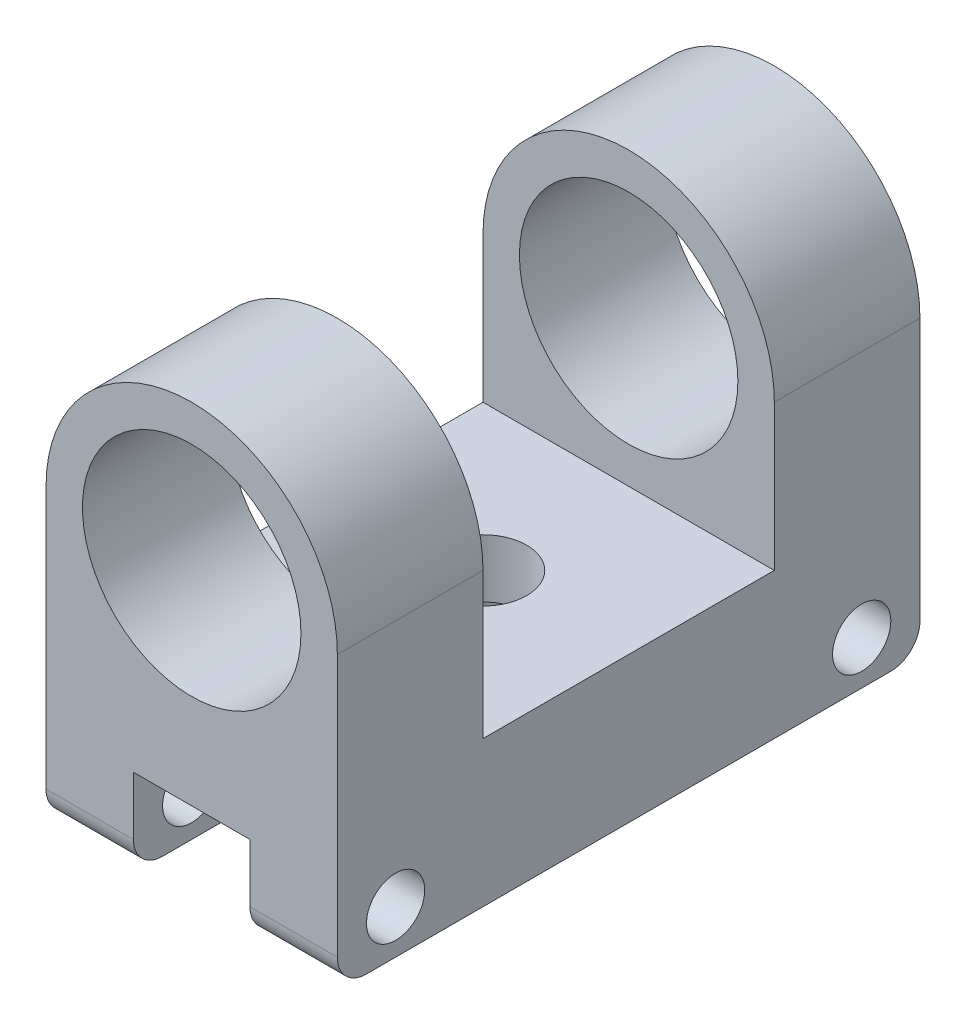
ISO-10303-21;
HEADER;
FILE_DESCRIPTION(('STEP AP214'),'2;1');
FILE_NAME('part.step','',(''),(''),'','','');
FILE_SCHEMA(('AUTOMOTIVE_DESIGN { 1 0 10303 214 1 1 1 1 }'));
ENDSEC;
DATA;
#1=APPLICATION_CONTEXT('core data for automotive mechanical design processes');
#2=APPLICATION_PROTOCOL_DEFINITION('international standard','automotive_design',2000,#1);
#3=PRODUCT_CONTEXT('',#1,'mechanical');
#4=PRODUCT('Part','Part','',(#3));
#5=PRODUCT_RELATED_PRODUCT_CATEGORY('part','',(#4));
#6=PRODUCT_DEFINITION_FORMATION('','',#4);
#7=PRODUCT_DEFINITION_CONTEXT('part definition',#1,'design');
#8=PRODUCT_DEFINITION('design','',#6,#7);
#9=PRODUCT_DEFINITION_SHAPE('','',#8);
#10=(LENGTH_UNIT() NAMED_UNIT(*) SI_UNIT(.MILLI.,.METRE.));
#11=(NAMED_UNIT(*) PLANE_ANGLE_UNIT() SI_UNIT($,.RADIAN.));
#12=(NAMED_UNIT(*) SI_UNIT($,.STERADIAN.) SOLID_ANGLE_UNIT());
#13=UNCERTAINTY_MEASURE_WITH_UNIT(LENGTH_MEASURE(1.E-05),#10,'distance_accuracy_value','');
#14=(GEOMETRIC_REPRESENTATION_CONTEXT(3) GLOBAL_UNCERTAINTY_ASSIGNED_CONTEXT((#13)) GLOBAL_UNIT_ASSIGNED_CONTEXT((#10,
#11,#12)) REPRESENTATION_CONTEXT('',''));
#15=CARTESIAN_POINT('',(0.,0.,0.));
#16=DIRECTION('',(0.,0.,1.));
#17=DIRECTION('',(1.,0.,0.));
#18=AXIS2_PLACEMENT_3D('',#15,#16,#17);
#19=CARTESIAN_POINT('',(50.,100.,-200.));
#20=DIRECTION('',(0.,0.,1.));
#21=DIRECTION('',(1.,0.,0.));
#22=AXIS2_PLACEMENT_3D('',#19,#20,#21);
#23=CYLINDRICAL_SURFACE('',#22,50.);
#24=CARTESIAN_POINT('',(50.,100.,-50.));
#25=DIRECTION('',(0.,0.,1.));
#26=DIRECTION('',(0.,-1.,0.));
#27=AXIS2_PLACEMENT_3D('',#24,#25,#26);
#28=CIRCLE('',#27,50.);
#29=CARTESIAN_POINT('',(0.,100.,-50.));
#30=VERTEX_POINT('',#29);
#31=CARTESIAN_POINT('',(100.,100.,-50.));
#32=VERTEX_POINT('',#31);
#33=EDGE_CURVE('E204',#30,#32,#28,.F.);
#34=ORIENTED_EDGE('',*,*,#33,.F.);
#35=DIRECTION('',(0.,0.,1.));
#36=VECTOR('',#35,1.);
#37=CARTESIAN_POINT('',(0.,100.,-200.));
#38=LINE('',#37,#36);
#39=CARTESIAN_POINT('',(0.,100.,0.));
#40=VERTEX_POINT('',#39);
#41=EDGE_CURVE('E302',#30,#40,#38,.T.);
#42=ORIENTED_EDGE('',*,*,#41,.T.);
#43=CARTESIAN_POINT('',(50.,100.,0.));
#44=DIRECTION('',(0.,0.,1.));
#45=DIRECTION('',(1.,0.,0.));
#46=AXIS2_PLACEMENT_3D('',#43,#44,#45);
#47=CIRCLE('',#46,50.);
#48=CARTESIAN_POINT('',(100.,100.,0.));
#49=VERTEX_POINT('',#48);
#50=EDGE_CURVE('E280',#49,#40,#47,.T.);
#51=ORIENTED_EDGE('',*,*,#50,.F.);
#52=DIRECTION('',(0.,0.,1.));
#53=VECTOR('',#52,1.);
#54=CARTESIAN_POINT('',(100.,100.,-200.));
#55=LINE('',#54,#53);
#56=EDGE_CURVE('E305',#32,#49,#55,.T.);
#57=ORIENTED_EDGE('',*,*,#56,.F.);
#58=EDGE_LOOP('',(#34,#42,#51,#57));
#59=FACE_BOUND('',#58,.T.);
#60=ADVANCED_FACE('F45',(#59),#23,.T.);
#61=CARTESIAN_POINT('',(50.,100.,-200.));
#62=DIRECTION('',(0.,0.,1.));
#63=DIRECTION('',(1.,0.,0.));
#64=AXIS2_PLACEMENT_3D('',#61,#62,#63);
#65=CYLINDRICAL_SURFACE('',#64,37.5);
#66=CARTESIAN_POINT('',(50.,100.,-50.));
#67=DIRECTION('',(0.,0.,1.));
#68=DIRECTION('',(0.,-1.,0.));
#69=AXIS2_PLACEMENT_3D('',#66,#67,#68);
#70=CIRCLE('',#69,37.5);
#71=CARTESIAN_POINT('',(50.,62.5,-50.));
#72=VERTEX_POINT('',#71);
#73=EDGE_CURVE('E203',#72,#72,#70,.F.);
#74=ORIENTED_EDGE('',*,*,#73,.T.);
#75=EDGE_LOOP('',(#74));
#76=FACE_BOUND('',#75,.T.);
#77=CARTESIAN_POINT('',(50.,100.,0.));
#78=DIRECTION('',(0.,0.,1.));
#79=DIRECTION('',(1.,0.,0.));
#80=AXIS2_PLACEMENT_3D('',#77,#78,#79);
#81=CIRCLE('',#80,37.5);
#82=CARTESIAN_POINT('',(87.5,100.,0.));
#83=VERTEX_POINT('',#82);
#84=EDGE_CURVE('E237',#83,#83,#81,.T.);
#85=ORIENTED_EDGE('',*,*,#84,.T.);
#86=EDGE_LOOP('',(#85));
#87=FACE_BOUND('',#86,.T.);
#88=ADVANCED_FACE('F407',(#76,#87),#65,.F.);
#89=CARTESIAN_POINT('',(0.,0.,-200.));
#90=DIRECTION('',(0.,-1.,0.));
#91=DIRECTION('',(0.,0.,-1.));
#92=AXIS2_PLACEMENT_3D('',#89,#90,#91);
#93=PLANE('',#92);
#94=DIRECTION('',(0.,0.,1.));
#95=VECTOR('',#94,1.);
#96=CARTESIAN_POINT('',(30.,0.,-200.));
#97=LINE('',#96,#95);
#98=CARTESIAN_POINT('',(30.,0.,-190.));
#99=VERTEX_POINT('',#98);
#100=CARTESIAN_POINT('',(30.,0.,-10.));
#101=VERTEX_POINT('',#100);
#102=EDGE_CURVE('E241',#99,#101,#97,.T.);
#103=ORIENTED_EDGE('',*,*,#102,.T.);
#104=DIRECTION('',(1.,0.,0.));
#105=VECTOR('',#104,1.);
#106=CARTESIAN_POINT('',(0.,0.,-10.));
#107=LINE('',#106,#105);
#108=CARTESIAN_POINT('',(0.,0.,-10.));
#109=VERTEX_POINT('',#108);
#110=EDGE_CURVE('E342',#101,#109,#107,.F.);
#111=ORIENTED_EDGE('',*,*,#110,.T.);
#112=DIRECTION('',(0.,0.,1.));
#113=VECTOR('',#112,1.);
#114=CARTESIAN_POINT('',(0.,0.,-200.));
#115=LINE('',#114,#113);
#116=CARTESIAN_POINT('',(0.,0.,-190.));
#117=VERTEX_POINT('',#116);
#118=EDGE_CURVE('E287',#117,#109,#115,.T.);
#119=ORIENTED_EDGE('',*,*,#118,.F.);
#120=DIRECTION('',(1.,0.,0.));
#121=VECTOR('',#120,1.);
#122=CARTESIAN_POINT('',(30.,0.,-190.));
#123=LINE('',#122,#121);
#124=EDGE_CURVE('E338',#117,#99,#123,.T.);
#125=ORIENTED_EDGE('',*,*,#124,.T.);
#126=EDGE_LOOP('',(#103,#111,#119,#125));
#127=FACE_BOUND('',#126,.T.);
#128=ADVANCED_FACE('F414',(#127),#93,.T.);
#129=CARTESIAN_POINT('',(50.,100.,-200.));
#130=DIRECTION('',(0.,0.,1.));
#131=DIRECTION('',(1.,0.,0.));
#132=AXIS2_PLACEMENT_3D('',#129,#130,#131);
#133=PLANE('',#132);
#134=CARTESIAN_POINT('',(50.,100.,-200.));
#135=DIRECTION('',(0.,0.,1.));
#136=DIRECTION('',(1.,0.,0.));
#137=AXIS2_PLACEMENT_3D('',#134,#135,#136);
#138=CIRCLE('',#137,37.5);
#139=CARTESIAN_POINT('',(87.5,100.,-200.));
#140=VERTEX_POINT('',#139);
#141=EDGE_CURVE('E232',#140,#140,#138,.T.);
#142=ORIENTED_EDGE('',*,*,#141,.T.);
#143=EDGE_LOOP('',(#142));
#144=FACE_BOUND('',#143,.T.);
#145=DIRECTION('',(0.,1.,0.));
#146=VECTOR('',#145,1.);
#147=CARTESIAN_POINT('',(30.,0.,-200.));
#148=LINE('',#147,#146);
#149=CARTESIAN_POINT('',(30.,10.,-200.));
#150=VERTEX_POINT('',#149);
#151=CARTESIAN_POINT('',(30.,30.,-200.));
#152=VERTEX_POINT('',#151);
#153=EDGE_CURVE('E250',#150,#152,#148,.T.);
#154=ORIENTED_EDGE('',*,*,#153,.F.);
#155=DIRECTION('',(1.,0.,0.));
#156=VECTOR('',#155,1.);
#157=CARTESIAN_POINT('',(0.,10.,-200.));
#158=LINE('',#157,#156);
#159=CARTESIAN_POINT('',(0.,10.,-200.));
#160=VERTEX_POINT('',#159);
#161=EDGE_CURVE('E11',#150,#160,#158,.F.);
#162=ORIENTED_EDGE('',*,*,#161,.T.);
#163=DIRECTION('',(0.,-1.,0.));
#164=VECTOR('',#163,1.);
#165=CARTESIAN_POINT('',(0.,0.,-200.));
#166=LINE('',#165,#164);
#167=CARTESIAN_POINT('',(0.,100.,-200.));
#168=VERTEX_POINT('',#167);
#169=EDGE_CURVE('E275',#168,#160,#166,.T.);
#170=ORIENTED_EDGE('',*,*,#169,.F.);
#171=CARTESIAN_POINT('',(50.,100.,-200.));
#172=DIRECTION('',(0.,0.,1.));
#173=DIRECTION('',(1.,0.,0.));
#174=AXIS2_PLACEMENT_3D('',#171,#172,#173);
#175=CIRCLE('',#174,50.);
#176=CARTESIAN_POINT('',(100.,100.,-200.));
#177=VERTEX_POINT('',#176);
#178=EDGE_CURVE('E283',#177,#168,#175,.T.);
#179=ORIENTED_EDGE('',*,*,#178,.F.);
#180=DIRECTION('',(0.,1.,0.));
#181=VECTOR('',#180,1.);
#182=CARTESIAN_POINT('',(100.,0.,-200.));
#183=LINE('',#182,#181);
#184=CARTESIAN_POINT('',(100.,10.,-200.));
#185=VERTEX_POINT('',#184);
#186=EDGE_CURVE('E279',#185,#177,#183,.T.);
#187=ORIENTED_EDGE('',*,*,#186,.F.);
#188=DIRECTION('',(1.,0.,0.));
#189=VECTOR('',#188,1.);
#190=CARTESIAN_POINT('',(70.,10.,-200.));
#191=LINE('',#190,#189);
#192=CARTESIAN_POINT('',(70.,10.,-200.));
#193=VERTEX_POINT('',#192);
#194=EDGE_CURVE('E54',#185,#193,#191,.F.);
#195=ORIENTED_EDGE('',*,*,#194,.T.);
#196=DIRECTION('',(0.,1.,0.));
#197=VECTOR('',#196,1.);
#198=CARTESIAN_POINT('',(70.,0.,-200.));
#199=LINE('',#198,#197);
#200=CARTESIAN_POINT('',(70.,30.,-200.));
#201=VERTEX_POINT('',#200);
#202=EDGE_CURVE('E242',#193,#201,#199,.T.);
#203=ORIENTED_EDGE('',*,*,#202,.T.);
#204=DIRECTION('',(1.,0.,0.));
#205=VECTOR('',#204,1.);
#206=CARTESIAN_POINT('',(0.,30.,-200.));
#207=LINE('',#206,#205);
#208=EDGE_CURVE('E245',#152,#201,#207,.T.);
#209=ORIENTED_EDGE('',*,*,#208,.F.);
#210=EDGE_LOOP('',(#154,#162,#170,#179,#187,#195,#203,#209));
#211=FACE_BOUND('',#210,.T.);
#212=ADVANCED_FACE('F465',(#144,#211),#133,.F.);
#213=CARTESIAN_POINT('',(50.,100.,0.));
#214=DIRECTION('',(0.,0.,1.));
#215=DIRECTION('',(1.,0.,0.));
#216=AXIS2_PLACEMENT_3D('',#213,#214,#215);
#217=PLANE('',#216);
#218=ORIENTED_EDGE('',*,*,#84,.F.);
#219=EDGE_LOOP('',(#218));
#220=FACE_BOUND('',#219,.T.);
#221=DIRECTION('',(0.,-1.,0.));
#222=VECTOR('',#221,1.);
#223=CARTESIAN_POINT('',(0.,0.,0.));
#224=LINE('',#223,#222);
#225=CARTESIAN_POINT('',(0.,9.99999999999999,0.));
#226=VERTEX_POINT('',#225);
#227=EDGE_CURVE('E236',#40,#226,#224,.T.);
#228=ORIENTED_EDGE('',*,*,#227,.T.);
#229=DIRECTION('',(1.,0.,0.));
#230=VECTOR('',#229,1.);
#231=CARTESIAN_POINT('',(50.,9.99999999999999,0.));
#232=LINE('',#231,#230);
#233=CARTESIAN_POINT('',(30.,9.99999999999999,0.));
#234=VERTEX_POINT('',#233);
#235=EDGE_CURVE('E328',#226,#234,#232,.T.);
#236=ORIENTED_EDGE('',*,*,#235,.T.);
#237=DIRECTION('',(0.,1.,0.));
#238=VECTOR('',#237,1.);
#239=CARTESIAN_POINT('',(30.,0.,0.));
#240=LINE('',#239,#238);
#241=CARTESIAN_POINT('',(30.,30.,0.));
#242=VERTEX_POINT('',#241);
#243=EDGE_CURVE('E246',#234,#242,#240,.T.);
#244=ORIENTED_EDGE('',*,*,#243,.T.);
#245=DIRECTION('',(1.,0.,0.));
#246=VECTOR('',#245,1.);
#247=CARTESIAN_POINT('',(0.,30.,0.));
#248=LINE('',#247,#246);
#249=CARTESIAN_POINT('',(70.,30.,0.));
#250=VERTEX_POINT('',#249);
#251=EDGE_CURVE('E256',#242,#250,#248,.T.);
#252=ORIENTED_EDGE('',*,*,#251,.T.);
#253=DIRECTION('',(0.,1.,0.));
#254=VECTOR('',#253,1.);
#255=CARTESIAN_POINT('',(70.,0.,0.));
#256=LINE('',#255,#254);
#257=CARTESIAN_POINT('',(70.,9.99999999999999,0.));
#258=VERTEX_POINT('',#257);
#259=EDGE_CURVE('E231',#258,#250,#256,.T.);
#260=ORIENTED_EDGE('',*,*,#259,.F.);
#261=DIRECTION('',(1.,0.,0.));
#262=VECTOR('',#261,1.);
#263=CARTESIAN_POINT('',(50.,9.99999999999999,0.));
#264=LINE('',#263,#262);
#265=CARTESIAN_POINT('',(100.,9.99999999999999,0.));
#266=VERTEX_POINT('',#265);
#267=EDGE_CURVE('E301',#258,#266,#264,.T.);
#268=ORIENTED_EDGE('',*,*,#267,.T.);
#269=DIRECTION('',(0.,1.,0.));
#270=VECTOR('',#269,1.);
#271=CARTESIAN_POINT('',(100.,0.,0.));
#272=LINE('',#271,#270);
#273=EDGE_CURVE('E291',#266,#49,#272,.T.);
#274=ORIENTED_EDGE('',*,*,#273,.T.);
#275=ORIENTED_EDGE('',*,*,#50,.T.);
#276=EDGE_LOOP('',(#228,#236,#244,#252,#260,#268,#274,#275));
#277=FACE_BOUND('',#276,.T.);
#278=ADVANCED_FACE('F431',(#220,#277),#217,.T.);
#279=CARTESIAN_POINT('',(0.,0.,-200.));
#280=DIRECTION('',(-1.,0.,0.));
#281=DIRECTION('',(0.,0.,1.));
#282=AXIS2_PLACEMENT_3D('',#279,#280,#281);
#283=PLANE('',#282);
#284=CARTESIAN_POINT('',(0.,15.,-20.));
#285=DIRECTION('',(-1.,0.,0.));
#286=DIRECTION('',(0.,0.,1.));
#287=AXIS2_PLACEMENT_3D('',#284,#285,#286);
#288=CIRCLE('',#287,10.);
#289=CARTESIAN_POINT('',(0.,15.,-10.));
#290=VERTEX_POINT('',#289);
#291=EDGE_CURVE('E224',#290,#290,#288,.T.);
#292=ORIENTED_EDGE('',*,*,#291,.F.);
#293=EDGE_LOOP('',(#292));
#294=FACE_BOUND('',#293,.T.);
#295=CARTESIAN_POINT('',(0.,15.,-180.));
#296=DIRECTION('',(-1.,0.,0.));
#297=DIRECTION('',(0.,0.,1.));
#298=AXIS2_PLACEMENT_3D('',#295,#296,#297);
#299=CIRCLE('',#298,10.);
#300=CARTESIAN_POINT('',(0.,15.,-170.));
#301=VERTEX_POINT('',#300);
#302=EDGE_CURVE('E215',#301,#301,#299,.T.);
#303=ORIENTED_EDGE('',*,*,#302,.F.);
#304=EDGE_LOOP('',(#303));
#305=FACE_BOUND('',#304,.T.);
#306=ORIENTED_EDGE('',*,*,#118,.T.);
#307=CARTESIAN_POINT('',(0.,9.99999999999999,-10.));
#308=DIRECTION('',(-1.,0.,0.));
#309=DIRECTION('',(0.,0.,1.));
#310=AXIS2_PLACEMENT_3D('',#307,#308,#309);
#311=CIRCLE('',#310,10.);
#312=EDGE_CURVE('E348',#109,#226,#311,.T.);
#313=ORIENTED_EDGE('',*,*,#312,.T.);
#314=ORIENTED_EDGE('',*,*,#227,.F.);
#315=ORIENTED_EDGE('',*,*,#41,.F.);
#316=DIRECTION('',(0.,1.,0.));
#317=VECTOR('',#316,1.);
#318=CARTESIAN_POINT('',(0.,0.,-50.));
#319=LINE('',#318,#317);
#320=CARTESIAN_POINT('',(0.,50.,-50.));
#321=VERTEX_POINT('',#320);
#322=EDGE_CURVE('E207',#321,#30,#319,.T.);
#323=ORIENTED_EDGE('',*,*,#322,.F.);
#324=DIRECTION('',(0.,0.,1.));
#325=VECTOR('',#324,1.);
#326=CARTESIAN_POINT('',(0.,50.,-200.));
#327=LINE('',#326,#325);
#328=CARTESIAN_POINT('',(0.,50.,-150.));
#329=VERTEX_POINT('',#328);
#330=EDGE_CURVE('E228',#329,#321,#327,.T.);
#331=ORIENTED_EDGE('',*,*,#330,.F.);
#332=DIRECTION('',(0.,-1.,0.));
#333=VECTOR('',#332,1.);
#334=CARTESIAN_POINT('',(0.,0.,-150.));
#335=LINE('',#334,#333);
#336=CARTESIAN_POINT('',(0.,100.,-150.));
#337=VERTEX_POINT('',#336);
#338=EDGE_CURVE('E168',#337,#329,#335,.T.);
#339=ORIENTED_EDGE('',*,*,#338,.F.);
#340=EDGE_CURVE('E297',#168,#337,#38,.T.);
#341=ORIENTED_EDGE('',*,*,#340,.F.);
#342=ORIENTED_EDGE('',*,*,#169,.T.);
#343=CARTESIAN_POINT('',(0.,10.,-190.));
#344=DIRECTION('',(-1.,0.,0.));
#345=DIRECTION('',(0.,0.,1.));
#346=AXIS2_PLACEMENT_3D('',#343,#344,#345);
#347=CIRCLE('',#346,10.);
#348=EDGE_CURVE('E345',#160,#117,#347,.T.);
#349=ORIENTED_EDGE('',*,*,#348,.T.);
#350=EDGE_LOOP('',(#306,#313,#314,#315,#323,#331,#339,#341,#342,#349));
#351=FACE_BOUND('',#350,.T.);
#352=ADVANCED_FACE('F422',(#294,#305,#351),#283,.T.);
#353=CARTESIAN_POINT('',(50.,100.,-150.));
#354=DIRECTION('',(0.,0.,-1.));
#355=DIRECTION('',(-1.,0.,0.));
#356=AXIS2_PLACEMENT_3D('',#353,#354,#355);
#357=CIRCLE('',#356,50.);
#358=CARTESIAN_POINT('',(100.,100.,-150.));
#359=VERTEX_POINT('',#358);
#360=EDGE_CURVE('E197',#359,#337,#357,.F.);
#361=ORIENTED_EDGE('',*,*,#360,.F.);
#362=EDGE_CURVE('E188',#177,#359,#55,.T.);
#363=ORIENTED_EDGE('',*,*,#362,.F.);
#364=ORIENTED_EDGE('',*,*,#178,.T.);
#365=ORIENTED_EDGE('',*,*,#340,.T.);
#366=EDGE_LOOP('',(#361,#363,#364,#365));
#367=FACE_BOUND('',#366,.T.);
#368=ADVANCED_FACE('F410',(#367),#23,.T.);
#369=CARTESIAN_POINT('',(100.,0.,-200.));
#370=DIRECTION('',(1.,0.,0.));
#371=DIRECTION('',(0.,0.,-1.));
#372=AXIS2_PLACEMENT_3D('',#369,#370,#371);
#373=PLANE('',#372);
#374=CARTESIAN_POINT('',(100.,15.,-20.));
#375=DIRECTION('',(1.,0.,0.));
#376=DIRECTION('',(0.,0.,-1.));
#377=AXIS2_PLACEMENT_3D('',#374,#375,#376);
#378=CIRCLE('',#377,10.);
#379=CARTESIAN_POINT('',(100.,15.,-30.));
#380=VERTEX_POINT('',#379);
#381=EDGE_CURVE('E315',#380,#380,#378,.T.);
#382=ORIENTED_EDGE('',*,*,#381,.F.);
#383=EDGE_LOOP('',(#382));
#384=FACE_BOUND('',#383,.T.);
#385=CARTESIAN_POINT('',(100.,15.,-180.));
#386=DIRECTION('',(1.,0.,0.));
#387=DIRECTION('',(0.,0.,-1.));
#388=AXIS2_PLACEMENT_3D('',#385,#386,#387);
#389=CIRCLE('',#388,10.);
#390=CARTESIAN_POINT('',(100.,15.,-190.));
#391=VERTEX_POINT('',#390);
#392=EDGE_CURVE('E196',#391,#391,#389,.T.);
#393=ORIENTED_EDGE('',*,*,#392,.F.);
#394=EDGE_LOOP('',(#393));
#395=FACE_BOUND('',#394,.T.);
#396=ORIENTED_EDGE('',*,*,#273,.F.);
#397=CARTESIAN_POINT('',(100.,9.99999999999999,-10.));
#398=DIRECTION('',(1.,0.,0.));
#399=DIRECTION('',(0.,0.,-1.));
#400=AXIS2_PLACEMENT_3D('',#397,#398,#399);
#401=CIRCLE('',#400,10.);
#402=CARTESIAN_POINT('',(100.,0.,-10.));
#403=VERTEX_POINT('',#402);
#404=EDGE_CURVE('E354',#266,#403,#401,.T.);
#405=ORIENTED_EDGE('',*,*,#404,.T.);
#406=DIRECTION('',(0.,0.,1.));
#407=VECTOR('',#406,1.);
#408=CARTESIAN_POINT('',(100.,0.,-200.));
#409=LINE('',#408,#407);
#410=CARTESIAN_POINT('',(100.,0.,-190.));
#411=VERTEX_POINT('',#410);
#412=EDGE_CURVE('E306',#411,#403,#409,.T.);
#413=ORIENTED_EDGE('',*,*,#412,.F.);
#414=CARTESIAN_POINT('',(100.,10.,-190.));
#415=DIRECTION('',(1.,0.,0.));
#416=DIRECTION('',(0.,0.,-1.));
#417=AXIS2_PLACEMENT_3D('',#414,#415,#416);
#418=CIRCLE('',#417,10.);
#419=EDGE_CURVE('E351',#411,#185,#418,.T.);
#420=ORIENTED_EDGE('',*,*,#419,.T.);
#421=ORIENTED_EDGE('',*,*,#186,.T.);
#422=ORIENTED_EDGE('',*,*,#362,.T.);
#423=DIRECTION('',(0.,1.,0.));
#424=VECTOR('',#423,1.);
#425=CARTESIAN_POINT('',(100.,150.,-150.));
#426=LINE('',#425,#424);
#427=CARTESIAN_POINT('',(100.,50.,-150.));
#428=VERTEX_POINT('',#427);
#429=EDGE_CURVE('E165',#428,#359,#426,.T.);
#430=ORIENTED_EDGE('',*,*,#429,.F.);
#431=DIRECTION('',(0.,0.,-1.));
#432=VECTOR('',#431,1.);
#433=CARTESIAN_POINT('',(100.,50.,-50.));
#434=LINE('',#433,#432);
#435=CARTESIAN_POINT('',(100.,50.,-50.));
#436=VERTEX_POINT('',#435);
#437=EDGE_CURVE('E177',#436,#428,#434,.T.);
#438=ORIENTED_EDGE('',*,*,#437,.F.);
#439=DIRECTION('',(0.,-1.,0.));
#440=VECTOR('',#439,1.);
#441=CARTESIAN_POINT('',(100.,150.,-50.));
#442=LINE('',#441,#440);
#443=EDGE_CURVE('E183',#32,#436,#442,.T.);
#444=ORIENTED_EDGE('',*,*,#443,.F.);
#445=ORIENTED_EDGE('',*,*,#56,.T.);
#446=EDGE_LOOP('',(#396,#405,#413,#420,#421,#422,#430,#438,#444,#445));
#447=FACE_BOUND('',#446,.T.);
#448=ADVANCED_FACE('F186',(#384,#395,#447),#373,.T.);
#449=ORIENTED_EDGE('',*,*,#412,.T.);
#450=DIRECTION('',(1.,0.,0.));
#451=VECTOR('',#450,1.);
#452=CARTESIAN_POINT('',(0.,0.,-10.));
#453=LINE('',#452,#451);
#454=CARTESIAN_POINT('',(70.,0.,-10.));
#455=VERTEX_POINT('',#454);
#456=EDGE_CURVE('E68',#403,#455,#453,.F.);
#457=ORIENTED_EDGE('',*,*,#456,.T.);
#458=DIRECTION('',(0.,0.,1.));
#459=VECTOR('',#458,1.);
#460=CARTESIAN_POINT('',(70.,0.,-200.));
#461=LINE('',#460,#459);
#462=CARTESIAN_POINT('',(70.,0.,-190.));
#463=VERTEX_POINT('',#462);
#464=EDGE_CURVE('E253',#463,#455,#461,.T.);
#465=ORIENTED_EDGE('',*,*,#464,.F.);
#466=DIRECTION('',(1.,0.,0.));
#467=VECTOR('',#466,1.);
#468=CARTESIAN_POINT('',(100.,0.,-190.));
#469=LINE('',#468,#467);
#470=EDGE_CURVE('E357',#463,#411,#469,.T.);
#471=ORIENTED_EDGE('',*,*,#470,.T.);
#472=EDGE_LOOP('',(#449,#457,#465,#471));
#473=FACE_BOUND('',#472,.T.);
#474=ADVANCED_FACE('F428',(#473),#93,.T.);
#475=CARTESIAN_POINT('',(30.,0.,-200.));
#476=DIRECTION('',(1.,0.,0.));
#477=DIRECTION('',(0.,0.,-1.));
#478=AXIS2_PLACEMENT_3D('',#475,#476,#477);
#479=PLANE('',#478);
#480=CARTESIAN_POINT('',(30.,15.,-20.));
#481=DIRECTION('',(1.,0.,0.));
#482=DIRECTION('',(0.,0.,-1.));
#483=AXIS2_PLACEMENT_3D('',#480,#481,#482);
#484=CIRCLE('',#483,10.);
#485=CARTESIAN_POINT('',(30.,15.,-30.));
#486=VERTEX_POINT('',#485);
#487=EDGE_CURVE('E220',#486,#486,#484,.T.);
#488=ORIENTED_EDGE('',*,*,#487,.F.);
#489=EDGE_LOOP('',(#488));
#490=FACE_BOUND('',#489,.T.);
#491=CARTESIAN_POINT('',(30.,15.,-180.));
#492=DIRECTION('',(1.,0.,0.));
#493=DIRECTION('',(0.,0.,-1.));
#494=AXIS2_PLACEMENT_3D('',#491,#492,#493);
#495=CIRCLE('',#494,10.);
#496=CARTESIAN_POINT('',(30.,15.,-190.));
#497=VERTEX_POINT('',#496);
#498=EDGE_CURVE('E211',#497,#497,#495,.T.);
#499=ORIENTED_EDGE('',*,*,#498,.F.);
#500=EDGE_LOOP('',(#499));
#501=FACE_BOUND('',#500,.T.);
#502=ORIENTED_EDGE('',*,*,#243,.F.);
#503=CARTESIAN_POINT('',(30.,9.99999999999999,-10.));
#504=DIRECTION('',(1.,0.,0.));
#505=DIRECTION('',(0.,0.,-1.));
#506=AXIS2_PLACEMENT_3D('',#503,#504,#505);
#507=CIRCLE('',#506,10.);
#508=EDGE_CURVE('E335',#234,#101,#507,.T.);
#509=ORIENTED_EDGE('',*,*,#508,.T.);
#510=ORIENTED_EDGE('',*,*,#102,.F.);
#511=CARTESIAN_POINT('',(30.,10.,-190.));
#512=DIRECTION('',(1.,0.,0.));
#513=DIRECTION('',(0.,0.,-1.));
#514=AXIS2_PLACEMENT_3D('',#511,#512,#513);
#515=CIRCLE('',#514,10.);
#516=EDGE_CURVE('E332',#99,#150,#515,.T.);
#517=ORIENTED_EDGE('',*,*,#516,.T.);
#518=ORIENTED_EDGE('',*,*,#153,.T.);
#519=DIRECTION('',(0.,0.,1.));
#520=VECTOR('',#519,1.);
#521=CARTESIAN_POINT('',(30.,30.,-200.));
#522=LINE('',#521,#520);
#523=EDGE_CURVE('E265',#152,#242,#522,.T.);
#524=ORIENTED_EDGE('',*,*,#523,.T.);
#525=EDGE_LOOP('',(#502,#509,#510,#517,#518,#524));
#526=FACE_BOUND('',#525,.T.);
#527=ADVANCED_FACE('F476',(#490,#501,#526),#479,.T.);
#528=CARTESIAN_POINT('',(0.,30.,-200.));
#529=DIRECTION('',(0.,-1.,0.));
#530=DIRECTION('',(0.,0.,-1.));
#531=AXIS2_PLACEMENT_3D('',#528,#529,#530);
#532=PLANE('',#531);
#533=CARTESIAN_POINT('',(50.,30.,-100.));
#534=DIRECTION('',(0.,-1.,0.));
#535=DIRECTION('',(0.,0.,-1.));
#536=AXIS2_PLACEMENT_3D('',#533,#534,#535);
#537=CIRCLE('',#536,15.);
#538=CARTESIAN_POINT('',(50.,30.,-115.));
#539=VERTEX_POINT('',#538);
#540=EDGE_CURVE('E173',#539,#539,#537,.T.);
#541=ORIENTED_EDGE('',*,*,#540,.F.);
#542=EDGE_LOOP('',(#541));
#543=FACE_BOUND('',#542,.T.);
#544=ORIENTED_EDGE('',*,*,#251,.F.);
#545=ORIENTED_EDGE('',*,*,#523,.F.);
#546=ORIENTED_EDGE('',*,*,#208,.T.);
#547=DIRECTION('',(0.,0.,1.));
#548=VECTOR('',#547,1.);
#549=CARTESIAN_POINT('',(70.,30.,-200.));
#550=LINE('',#549,#548);
#551=EDGE_CURVE('E269',#201,#250,#550,.T.);
#552=ORIENTED_EDGE('',*,*,#551,.T.);
#553=EDGE_LOOP('',(#544,#545,#546,#552));
#554=FACE_BOUND('',#553,.T.);
#555=ADVANCED_FACE('F460',(#543,#554),#532,.T.);
#556=CARTESIAN_POINT('',(70.,0.,-200.));
#557=DIRECTION('',(1.,0.,0.));
#558=DIRECTION('',(0.,0.,-1.));
#559=AXIS2_PLACEMENT_3D('',#556,#557,#558);
#560=PLANE('',#559);
#561=CARTESIAN_POINT('',(70.,15.,-20.));
#562=DIRECTION('',(1.,0.,0.));
#563=DIRECTION('',(0.,0.,-1.));
#564=AXIS2_PLACEMENT_3D('',#561,#562,#563);
#565=CIRCLE('',#564,10.);
#566=CARTESIAN_POINT('',(70.,15.,-30.));
#567=VERTEX_POINT('',#566);
#568=EDGE_CURVE('E219',#567,#567,#565,.T.);
#569=ORIENTED_EDGE('',*,*,#568,.T.);
#570=EDGE_LOOP('',(#569));
#571=FACE_BOUND('',#570,.T.);
#572=CARTESIAN_POINT('',(70.,15.,-180.));
#573=DIRECTION('',(1.,0.,0.));
#574=DIRECTION('',(0.,0.,-1.));
#575=AXIS2_PLACEMENT_3D('',#572,#573,#574);
#576=CIRCLE('',#575,10.);
#577=CARTESIAN_POINT('',(70.,15.,-190.));
#578=VERTEX_POINT('',#577);
#579=EDGE_CURVE('E210',#578,#578,#576,.T.);
#580=ORIENTED_EDGE('',*,*,#579,.T.);
#581=EDGE_LOOP('',(#580));
#582=FACE_BOUND('',#581,.T.);
#583=ORIENTED_EDGE('',*,*,#464,.T.);
#584=CARTESIAN_POINT('',(70.,9.99999999999999,-10.));
#585=DIRECTION('',(1.,0.,0.));
#586=DIRECTION('',(0.,0.,-1.));
#587=AXIS2_PLACEMENT_3D('',#584,#585,#586);
#588=CIRCLE('',#587,10.);
#589=EDGE_CURVE('E366',#455,#258,#588,.F.);
#590=ORIENTED_EDGE('',*,*,#589,.T.);
#591=ORIENTED_EDGE('',*,*,#259,.T.);
#592=ORIENTED_EDGE('',*,*,#551,.F.);
#593=ORIENTED_EDGE('',*,*,#202,.F.);
#594=CARTESIAN_POINT('',(70.,10.,-190.));
#595=DIRECTION('',(1.,0.,0.));
#596=DIRECTION('',(0.,0.,-1.));
#597=AXIS2_PLACEMENT_3D('',#594,#595,#596);
#598=CIRCLE('',#597,10.);
#599=EDGE_CURVE('E363',#193,#463,#598,.F.);
#600=ORIENTED_EDGE('',*,*,#599,.T.);
#601=EDGE_LOOP('',(#583,#590,#591,#592,#593,#600));
#602=FACE_BOUND('',#601,.T.);
#603=ADVANCED_FACE('F454',(#571,#582,#602),#560,.F.);
#604=CARTESIAN_POINT('',(50.,100.,-150.));
#605=DIRECTION('',(0.,0.,-1.));
#606=DIRECTION('',(-1.,0.,0.));
#607=AXIS2_PLACEMENT_3D('',#604,#605,#606);
#608=CIRCLE('',#607,37.5);
#609=CARTESIAN_POINT('',(12.5,100.,-150.));
#610=VERTEX_POINT('',#609);
#611=EDGE_CURVE('E200',#610,#610,#608,.F.);
#612=ORIENTED_EDGE('',*,*,#611,.T.);
#613=EDGE_LOOP('',(#612));
#614=FACE_BOUND('',#613,.T.);
#615=ORIENTED_EDGE('',*,*,#141,.F.);
#616=EDGE_LOOP('',(#615));
#617=FACE_BOUND('',#616,.T.);
#618=ADVANCED_FACE('F417',(#614,#617),#65,.F.);
#619=CARTESIAN_POINT('',(-100.,150.,-50.));
#620=DIRECTION('',(0.,0.,1.));
#621=DIRECTION('',(0.,-1.,0.));
#622=AXIS2_PLACEMENT_3D('',#619,#620,#621);
#623=PLANE('',#622);
#624=ORIENTED_EDGE('',*,*,#322,.T.);
#625=ORIENTED_EDGE('',*,*,#33,.T.);
#626=ORIENTED_EDGE('',*,*,#443,.T.);
#627=DIRECTION('',(1.,0.,0.));
#628=VECTOR('',#627,1.);
#629=CARTESIAN_POINT('',(-100.,50.,-50.));
#630=LINE('',#629,#628);
#631=EDGE_CURVE('E172',#321,#436,#630,.T.);
#632=ORIENTED_EDGE('',*,*,#631,.F.);
#633=EDGE_LOOP('',(#624,#625,#626,#632));
#634=FACE_BOUND('',#633,.T.);
#635=ORIENTED_EDGE('',*,*,#73,.F.);
#636=EDGE_LOOP('',(#635));
#637=FACE_BOUND('',#636,.T.);
#638=ADVANCED_FACE('F403',(#634,#637),#623,.F.);
#639=CARTESIAN_POINT('',(-100.,150.,-150.));
#640=DIRECTION('',(0.,0.,-1.));
#641=DIRECTION('',(-1.,0.,0.));
#642=AXIS2_PLACEMENT_3D('',#639,#640,#641);
#643=PLANE('',#642);
#644=ORIENTED_EDGE('',*,*,#338,.T.);
#645=DIRECTION('',(1.,0.,0.));
#646=VECTOR('',#645,1.);
#647=CARTESIAN_POINT('',(-100.,50.,-150.));
#648=LINE('',#647,#646);
#649=EDGE_CURVE('E160',#329,#428,#648,.T.);
#650=ORIENTED_EDGE('',*,*,#649,.T.);
#651=ORIENTED_EDGE('',*,*,#429,.T.);
#652=ORIENTED_EDGE('',*,*,#360,.T.);
#653=EDGE_LOOP('',(#644,#650,#651,#652));
#654=FACE_BOUND('',#653,.T.);
#655=ORIENTED_EDGE('',*,*,#611,.F.);
#656=EDGE_LOOP('',(#655));
#657=FACE_BOUND('',#656,.T.);
#658=ADVANCED_FACE('F162',(#654,#657),#643,.F.);
#659=CARTESIAN_POINT('',(-100.,50.,-50.));
#660=DIRECTION('',(0.,-1.,0.));
#661=DIRECTION('',(0.,0.,-1.));
#662=AXIS2_PLACEMENT_3D('',#659,#660,#661);
#663=PLANE('',#662);
#664=CARTESIAN_POINT('',(50.,50.,-100.));
#665=DIRECTION('',(0.,1.,0.));
#666=DIRECTION('',(0.,0.,1.));
#667=AXIS2_PLACEMENT_3D('',#664,#665,#666);
#668=CIRCLE('',#667,15.);
#669=CARTESIAN_POINT('',(50.,50.,-85.));
#670=VERTEX_POINT('',#669);
#671=EDGE_CURVE('E384',#670,#670,#668,.T.);
#672=ORIENTED_EDGE('',*,*,#671,.F.);
#673=EDGE_LOOP('',(#672));
#674=FACE_BOUND('',#673,.T.);
#675=ORIENTED_EDGE('',*,*,#330,.T.);
#676=ORIENTED_EDGE('',*,*,#631,.T.);
#677=ORIENTED_EDGE('',*,*,#437,.T.);
#678=ORIENTED_EDGE('',*,*,#649,.F.);
#679=EDGE_LOOP('',(#675,#676,#677,#678));
#680=FACE_BOUND('',#679,.T.);
#681=ADVANCED_FACE('F178',(#674,#680),#663,.F.);
#682=CARTESIAN_POINT('',(-100.,15.,-180.));
#683=DIRECTION('',(1.,0.,0.));
#684=DIRECTION('',(0.,0.,-1.));
#685=AXIS2_PLACEMENT_3D('',#682,#683,#684);
#686=CYLINDRICAL_SURFACE('',#685,10.);
#687=ORIENTED_EDGE('',*,*,#392,.T.);
#688=EDGE_LOOP('',(#687));
#689=FACE_BOUND('',#688,.T.);
#690=ORIENTED_EDGE('',*,*,#579,.F.);
#691=EDGE_LOOP('',(#690));
#692=FACE_BOUND('',#691,.T.);
#693=ADVANCED_FACE('F392',(#689,#692),#686,.F.);
#694=CARTESIAN_POINT('',(-100.,15.,-20.));
#695=DIRECTION('',(1.,0.,0.));
#696=DIRECTION('',(0.,0.,-1.));
#697=AXIS2_PLACEMENT_3D('',#694,#695,#696);
#698=CYLINDRICAL_SURFACE('',#697,10.);
#699=ORIENTED_EDGE('',*,*,#381,.T.);
#700=EDGE_LOOP('',(#699));
#701=FACE_BOUND('',#700,.T.);
#702=ORIENTED_EDGE('',*,*,#568,.F.);
#703=EDGE_LOOP('',(#702));
#704=FACE_BOUND('',#703,.T.);
#705=ADVANCED_FACE('F399',(#701,#704),#698,.F.);
#706=ORIENTED_EDGE('',*,*,#302,.T.);
#707=EDGE_LOOP('',(#706));
#708=FACE_BOUND('',#707,.T.);
#709=ORIENTED_EDGE('',*,*,#498,.T.);
#710=EDGE_LOOP('',(#709));
#711=FACE_BOUND('',#710,.T.);
#712=ADVANCED_FACE('F401',(#708,#711),#686,.F.);
#713=ORIENTED_EDGE('',*,*,#291,.T.);
#714=EDGE_LOOP('',(#713));
#715=FACE_BOUND('',#714,.T.);
#716=ORIENTED_EDGE('',*,*,#487,.T.);
#717=EDGE_LOOP('',(#716));
#718=FACE_BOUND('',#717,.T.);
#719=ADVANCED_FACE('F487',(#715,#718),#698,.F.);
#720=CARTESIAN_POINT('',(50.,-150.,-100.));
#721=DIRECTION('',(0.,1.,0.));
#722=DIRECTION('',(0.,0.,1.));
#723=AXIS2_PLACEMENT_3D('',#720,#721,#722);
#724=CYLINDRICAL_SURFACE('',#723,15.);
#725=ORIENTED_EDGE('',*,*,#540,.T.);
#726=EDGE_LOOP('',(#725));
#727=FACE_BOUND('',#726,.T.);
#728=ORIENTED_EDGE('',*,*,#671,.T.);
#729=EDGE_LOOP('',(#728));
#730=FACE_BOUND('',#729,.T.);
#731=ADVANCED_FACE('F389',(#727,#730),#724,.F.);
#732=CARTESIAN_POINT('',(50.,9.99999999999999,-10.));
#733=DIRECTION('',(1.,0.,0.));
#734=DIRECTION('',(0.,0.,-1.));
#735=AXIS2_PLACEMENT_3D('',#732,#733,#734);
#736=CYLINDRICAL_SURFACE('',#735,10.);
#737=ORIENTED_EDGE('',*,*,#312,.F.);
#738=ORIENTED_EDGE('',*,*,#110,.F.);
#739=ORIENTED_EDGE('',*,*,#508,.F.);
#740=ORIENTED_EDGE('',*,*,#235,.F.);
#741=EDGE_LOOP('',(#737,#738,#739,#740));
#742=FACE_BOUND('',#741,.T.);
#743=ADVANCED_FACE('F479',(#742),#736,.T.);
#744=CARTESIAN_POINT('',(50.,9.99999999999999,-10.));
#745=DIRECTION('',(1.,0.,0.));
#746=DIRECTION('',(0.,0.,-1.));
#747=AXIS2_PLACEMENT_3D('',#744,#745,#746);
#748=CYLINDRICAL_SURFACE('',#747,10.);
#749=ORIENTED_EDGE('',*,*,#589,.F.);
#750=ORIENTED_EDGE('',*,*,#456,.F.);
#751=ORIENTED_EDGE('',*,*,#404,.F.);
#752=ORIENTED_EDGE('',*,*,#267,.F.);
#753=EDGE_LOOP('',(#749,#750,#751,#752));
#754=FACE_BOUND('',#753,.T.);
#755=ADVANCED_FACE('F452',(#754),#748,.T.);
#756=CARTESIAN_POINT('',(0.,10.,-190.));
#757=DIRECTION('',(-1.,0.,0.));
#758=DIRECTION('',(0.,0.,1.));
#759=AXIS2_PLACEMENT_3D('',#756,#757,#758);
#760=CYLINDRICAL_SURFACE('',#759,10.);
#761=ORIENTED_EDGE('',*,*,#348,.F.);
#762=ORIENTED_EDGE('',*,*,#161,.F.);
#763=ORIENTED_EDGE('',*,*,#516,.F.);
#764=ORIENTED_EDGE('',*,*,#124,.F.);
#765=EDGE_LOOP('',(#761,#762,#763,#764));
#766=FACE_BOUND('',#765,.T.);
#767=ADVANCED_FACE('F471',(#766),#760,.T.);
#768=CARTESIAN_POINT('',(0.,10.,-190.));
#769=DIRECTION('',(-1.,0.,0.));
#770=DIRECTION('',(0.,0.,1.));
#771=AXIS2_PLACEMENT_3D('',#768,#769,#770);
#772=CYLINDRICAL_SURFACE('',#771,10.);
#773=ORIENTED_EDGE('',*,*,#599,.F.);
#774=ORIENTED_EDGE('',*,*,#194,.F.);
#775=ORIENTED_EDGE('',*,*,#419,.F.);
#776=ORIENTED_EDGE('',*,*,#470,.F.);
#777=EDGE_LOOP('',(#773,#774,#775,#776));
#778=FACE_BOUND('',#777,.T.);
#779=ADVANCED_FACE('F47',(#778),#772,.T.);
#780=CLOSED_SHELL('',(#60,#88,#128,#212,#278,#352,#368,#448,#474,#527,#555,#603,#618,#638,#658,
#681,#693,#705,#712,#719,#731,#743,#755,#767,#779));
#781=MANIFOLD_SOLID_BREP('B2',#780);
#782=ADVANCED_BREP_SHAPE_REPRESENTATION('',(#18,#781),#14);
#783=SHAPE_DEFINITION_REPRESENTATION(#9,#782);
ENDSEC;
END-ISO-10303-21;
